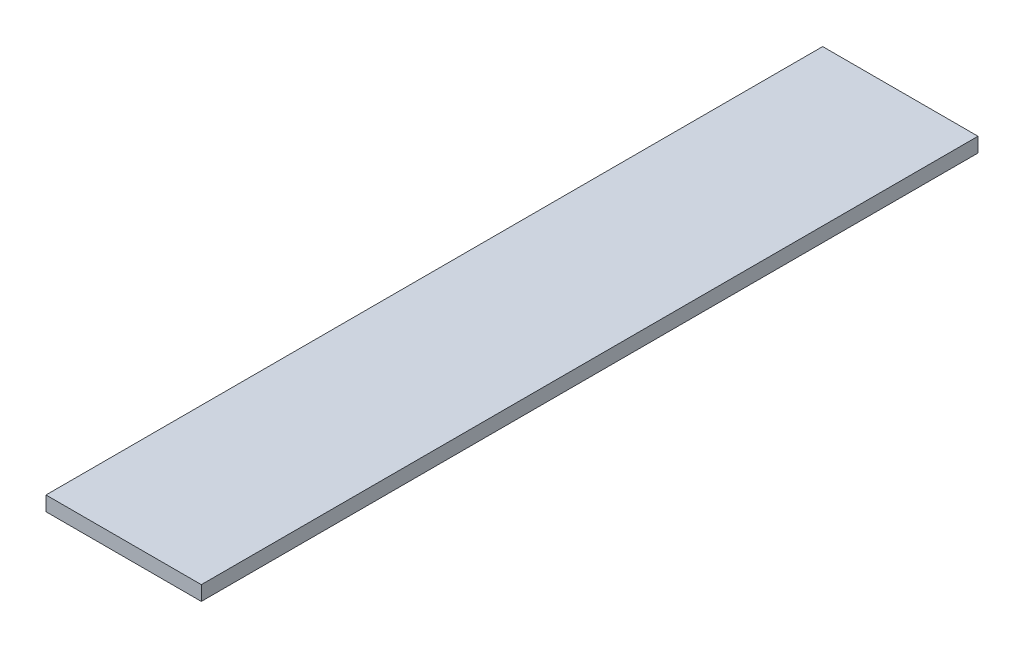
ISO-10303-21;
HEADER;
FILE_DESCRIPTION(('STEP AP214'),'2;1');
FILE_NAME('part.step','',(''),(''),'','','');
FILE_SCHEMA(('AUTOMOTIVE_DESIGN { 1 0 10303 214 1 1 1 1 }'));
ENDSEC;
DATA;
#1=APPLICATION_CONTEXT('core data for automotive mechanical design processes');
#2=APPLICATION_PROTOCOL_DEFINITION('international standard','automotive_design',2000,#1);
#3=PRODUCT_CONTEXT('',#1,'mechanical');
#4=PRODUCT('Part','Part','',(#3));
#5=PRODUCT_RELATED_PRODUCT_CATEGORY('part','',(#4));
#6=PRODUCT_DEFINITION_FORMATION('','',#4);
#7=PRODUCT_DEFINITION_CONTEXT('part definition',#1,'design');
#8=PRODUCT_DEFINITION('design','',#6,#7);
#9=PRODUCT_DEFINITION_SHAPE('','',#8);
#10=(LENGTH_UNIT() NAMED_UNIT(*) SI_UNIT(.MILLI.,.METRE.));
#11=(NAMED_UNIT(*) PLANE_ANGLE_UNIT() SI_UNIT($,.RADIAN.));
#12=(NAMED_UNIT(*) SI_UNIT($,.STERADIAN.) SOLID_ANGLE_UNIT());
#13=UNCERTAINTY_MEASURE_WITH_UNIT(LENGTH_MEASURE(1.E-05),#10,'distance_accuracy_value','');
#14=(GEOMETRIC_REPRESENTATION_CONTEXT(3) GLOBAL_UNCERTAINTY_ASSIGNED_CONTEXT((#13)) GLOBAL_UNIT_ASSIGNED_CONTEXT((#10,
#11,#12)) REPRESENTATION_CONTEXT('',''));
#15=CARTESIAN_POINT('',(0.,0.,0.));
#16=DIRECTION('',(0.,0.,1.));
#17=DIRECTION('',(1.,0.,0.));
#18=AXIS2_PLACEMENT_3D('',#15,#16,#17);
#19=CARTESIAN_POINT('',(0.,4.7625,0.));
#20=DIRECTION('',(1.,0.,0.));
#21=DIRECTION('',(0.,0.,-1.));
#22=AXIS2_PLACEMENT_3D('',#19,#20,#21);
#23=PLANE('',#22);
#24=DIRECTION('',(0.,0.,1.));
#25=VECTOR('',#24,1.);
#26=CARTESIAN_POINT('',(0.,0.,0.));
#27=LINE('',#26,#25);
#28=CARTESIAN_POINT('',(0.,0.,0.));
#29=VERTEX_POINT('',#28);
#30=CARTESIAN_POINT('',(0.,0.,254.));
#31=VERTEX_POINT('',#30);
#32=EDGE_CURVE('E96',#29,#31,#27,.T.);
#33=ORIENTED_EDGE('',*,*,#32,.T.);
#34=DIRECTION('',(0.,-1.,0.));
#35=VECTOR('',#34,1.);
#36=CARTESIAN_POINT('',(0.,4.7625,254.));
#37=LINE('',#36,#35);
#38=CARTESIAN_POINT('',(0.,4.7625,254.));
#39=VERTEX_POINT('',#38);
#40=EDGE_CURVE('E11',#39,#31,#37,.T.);
#41=ORIENTED_EDGE('',*,*,#40,.F.);
#42=DIRECTION('',(0.,0.,1.));
#43=VECTOR('',#42,1.);
#44=CARTESIAN_POINT('',(0.,4.7625,0.));
#45=LINE('',#44,#43);
#46=CARTESIAN_POINT('',(0.,4.7625,0.));
#47=VERTEX_POINT('',#46);
#48=EDGE_CURVE('E82',#47,#39,#45,.T.);
#49=ORIENTED_EDGE('',*,*,#48,.F.);
#50=DIRECTION('',(0.,-1.,0.));
#51=VECTOR('',#50,1.);
#52=CARTESIAN_POINT('',(0.,4.7625,0.));
#53=LINE('',#52,#51);
#54=EDGE_CURVE('E49',#47,#29,#53,.T.);
#55=ORIENTED_EDGE('',*,*,#54,.T.);
#56=EDGE_LOOP('',(#33,#41,#49,#55));
#57=FACE_BOUND('',#56,.T.);
#58=ADVANCED_FACE('F33',(#57),#23,.F.);
#59=CARTESIAN_POINT('',(0.,4.7625,254.));
#60=DIRECTION('',(0.,0.,-1.));
#61=DIRECTION('',(-1.,0.,0.));
#62=AXIS2_PLACEMENT_3D('',#59,#60,#61);
#63=PLANE('',#62);
#64=DIRECTION('',(1.,0.,0.));
#65=VECTOR('',#64,1.);
#66=CARTESIAN_POINT('',(0.,0.,254.));
#67=LINE('',#66,#65);
#68=CARTESIAN_POINT('',(50.8,0.,254.));
#69=VERTEX_POINT('',#68);
#70=EDGE_CURVE('E87',#31,#69,#67,.T.);
#71=ORIENTED_EDGE('',*,*,#70,.T.);
#72=DIRECTION('',(0.,-1.,0.));
#73=VECTOR('',#72,1.);
#74=CARTESIAN_POINT('',(50.8,4.7625,254.));
#75=LINE('',#74,#73);
#76=CARTESIAN_POINT('',(50.8,4.7625,254.));
#77=VERTEX_POINT('',#76);
#78=EDGE_CURVE('E41',#77,#69,#75,.T.);
#79=ORIENTED_EDGE('',*,*,#78,.F.);
#80=DIRECTION('',(1.,0.,0.));
#81=VECTOR('',#80,1.);
#82=CARTESIAN_POINT('',(0.,4.7625,254.));
#83=LINE('',#82,#81);
#84=EDGE_CURVE('E74',#39,#77,#83,.T.);
#85=ORIENTED_EDGE('',*,*,#84,.F.);
#86=ORIENTED_EDGE('',*,*,#40,.T.);
#87=EDGE_LOOP('',(#71,#79,#85,#86));
#88=FACE_BOUND('',#87,.T.);
#89=ADVANCED_FACE('F86',(#88),#63,.F.);
#90=CARTESIAN_POINT('',(50.8,4.7625,0.));
#91=DIRECTION('',(1.,0.,0.));
#92=DIRECTION('',(0.,0.,-1.));
#93=AXIS2_PLACEMENT_3D('',#90,#91,#92);
#94=PLANE('',#93);
#95=DIRECTION('',(0.,0.,1.));
#96=VECTOR('',#95,1.);
#97=CARTESIAN_POINT('',(50.8,0.,0.));
#98=LINE('',#97,#96);
#99=CARTESIAN_POINT('',(50.8,0.,0.));
#100=VERTEX_POINT('',#99);
#101=EDGE_CURVE('E99',#100,#69,#98,.T.);
#102=ORIENTED_EDGE('',*,*,#101,.F.);
#103=DIRECTION('',(0.,-1.,0.));
#104=VECTOR('',#103,1.);
#105=CARTESIAN_POINT('',(50.8,4.7625,0.));
#106=LINE('',#105,#104);
#107=CARTESIAN_POINT('',(50.8,4.7625,0.));
#108=VERTEX_POINT('',#107);
#109=EDGE_CURVE('E63',#108,#100,#106,.T.);
#110=ORIENTED_EDGE('',*,*,#109,.F.);
#111=DIRECTION('',(0.,0.,1.));
#112=VECTOR('',#111,1.);
#113=CARTESIAN_POINT('',(50.8,4.7625,0.));
#114=LINE('',#113,#112);
#115=EDGE_CURVE('E81',#108,#77,#114,.T.);
#116=ORIENTED_EDGE('',*,*,#115,.T.);
#117=ORIENTED_EDGE('',*,*,#78,.T.);
#118=EDGE_LOOP('',(#102,#110,#116,#117));
#119=FACE_BOUND('',#118,.T.);
#120=ADVANCED_FACE('F90',(#119),#94,.T.);
#121=CARTESIAN_POINT('',(0.,4.7625,0.));
#122=DIRECTION('',(0.,0.,-1.));
#123=DIRECTION('',(-1.,0.,0.));
#124=AXIS2_PLACEMENT_3D('',#121,#122,#123);
#125=PLANE('',#124);
#126=DIRECTION('',(1.,0.,0.));
#127=VECTOR('',#126,1.);
#128=CARTESIAN_POINT('',(0.,0.,0.));
#129=LINE('',#128,#127);
#130=EDGE_CURVE('E101',#29,#100,#129,.T.);
#131=ORIENTED_EDGE('',*,*,#130,.F.);
#132=ORIENTED_EDGE('',*,*,#54,.F.);
#133=DIRECTION('',(1.,0.,0.));
#134=VECTOR('',#133,1.);
#135=CARTESIAN_POINT('',(0.,4.7625,0.));
#136=LINE('',#135,#134);
#137=EDGE_CURVE('E91',#47,#108,#136,.T.);
#138=ORIENTED_EDGE('',*,*,#137,.T.);
#139=ORIENTED_EDGE('',*,*,#109,.T.);
#140=EDGE_LOOP('',(#131,#132,#138,#139));
#141=FACE_BOUND('',#140,.T.);
#142=ADVANCED_FACE('F107',(#141),#125,.T.);
#143=CARTESIAN_POINT('',(0.,4.7625,0.));
#144=DIRECTION('',(0.,1.,0.));
#145=DIRECTION('',(0.,0.,1.));
#146=AXIS2_PLACEMENT_3D('',#143,#144,#145);
#147=PLANE('',#146);
#148=ORIENTED_EDGE('',*,*,#48,.T.);
#149=ORIENTED_EDGE('',*,*,#84,.T.);
#150=ORIENTED_EDGE('',*,*,#115,.F.);
#151=ORIENTED_EDGE('',*,*,#137,.F.);
#152=EDGE_LOOP('',(#148,#149,#150,#151));
#153=FACE_BOUND('',#152,.T.);
#154=ADVANCED_FACE('F78',(#153),#147,.T.);
#155=CARTESIAN_POINT('',(0.,0.,0.));
#156=DIRECTION('',(0.,1.,0.));
#157=DIRECTION('',(0.,0.,1.));
#158=AXIS2_PLACEMENT_3D('',#155,#156,#157);
#159=PLANE('',#158);
#160=ORIENTED_EDGE('',*,*,#32,.F.);
#161=ORIENTED_EDGE('',*,*,#130,.T.);
#162=ORIENTED_EDGE('',*,*,#101,.T.);
#163=ORIENTED_EDGE('',*,*,#70,.F.);
#164=EDGE_LOOP('',(#160,#161,#162,#163));
#165=FACE_BOUND('',#164,.T.);
#166=ADVANCED_FACE('F106',(#165),#159,.F.);
#167=CLOSED_SHELL('',(#58,#89,#120,#142,#154,#166));
#168=MANIFOLD_SOLID_BREP('B2',#167);
#169=ADVANCED_BREP_SHAPE_REPRESENTATION('',(#18,#168),#14);
#170=SHAPE_DEFINITION_REPRESENTATION(#9,#169);
ENDSEC;
END-ISO-10303-21;
